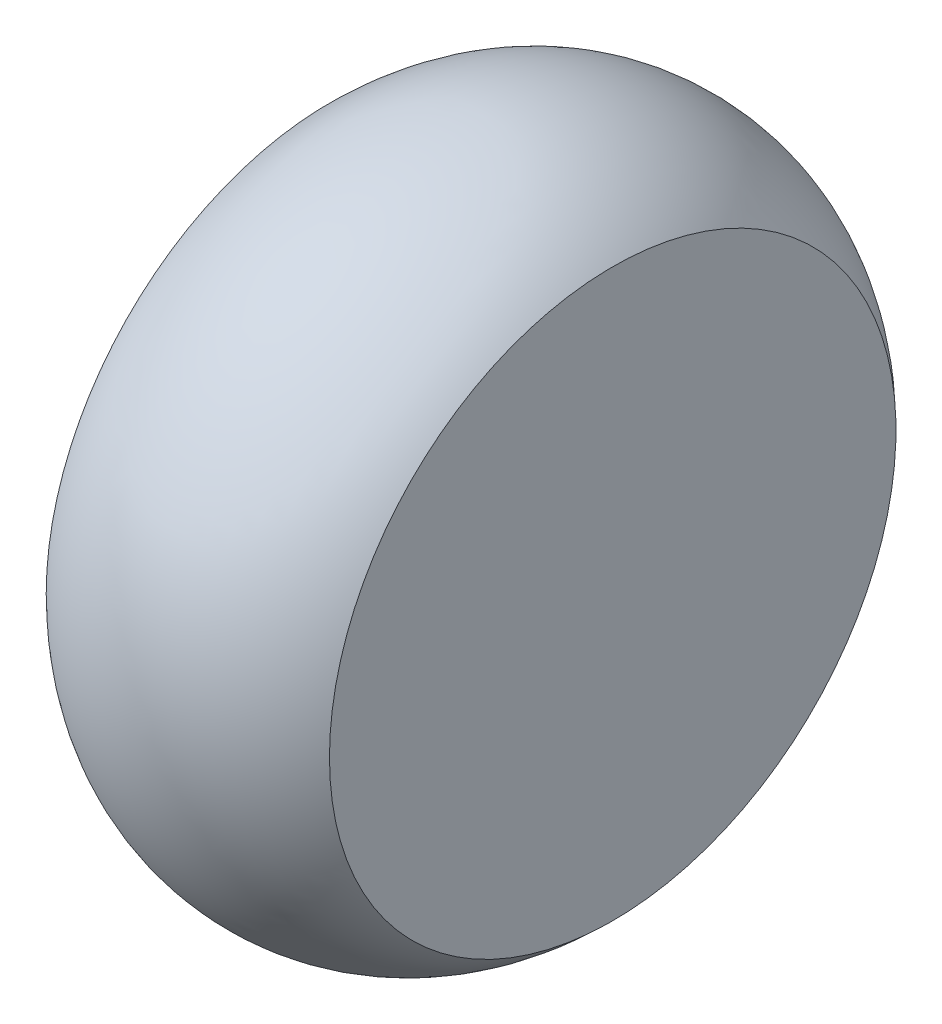
ISO-10303-21;
HEADER;
FILE_DESCRIPTION(('STEP AP214'),'2;1');
FILE_NAME('part.step','',(''),(''),'','','');
FILE_SCHEMA(('AUTOMOTIVE_DESIGN { 1 0 10303 214 1 1 1 1 }'));
ENDSEC;
DATA;
#1=APPLICATION_CONTEXT('core data for automotive mechanical design processes');
#2=APPLICATION_PROTOCOL_DEFINITION('international standard','automotive_design',2000,#1);
#3=PRODUCT_CONTEXT('',#1,'mechanical');
#4=PRODUCT('Part','Part','',(#3));
#5=PRODUCT_RELATED_PRODUCT_CATEGORY('part','',(#4));
#6=PRODUCT_DEFINITION_FORMATION('','',#4);
#7=PRODUCT_DEFINITION_CONTEXT('part definition',#1,'design');
#8=PRODUCT_DEFINITION('design','',#6,#7);
#9=PRODUCT_DEFINITION_SHAPE('','',#8);
#10=(LENGTH_UNIT() NAMED_UNIT(*) SI_UNIT(.MILLI.,.METRE.));
#11=(NAMED_UNIT(*) PLANE_ANGLE_UNIT() SI_UNIT($,.RADIAN.));
#12=(NAMED_UNIT(*) SI_UNIT($,.STERADIAN.) SOLID_ANGLE_UNIT());
#13=UNCERTAINTY_MEASURE_WITH_UNIT(LENGTH_MEASURE(1.E-05),#10,'distance_accuracy_value','');
#14=(GEOMETRIC_REPRESENTATION_CONTEXT(3) GLOBAL_UNCERTAINTY_ASSIGNED_CONTEXT((#13)) GLOBAL_UNIT_ASSIGNED_CONTEXT((#10,
#11,#12)) REPRESENTATION_CONTEXT('',''));
#15=CARTESIAN_POINT('',(0.,0.,0.));
#16=DIRECTION('',(0.,0.,1.));
#17=DIRECTION('',(1.,0.,0.));
#18=AXIS2_PLACEMENT_3D('',#15,#16,#17);
#19=CARTESIAN_POINT('',(20.,0.,0.));
#20=DIRECTION('',(1.,0.,0.));
#21=DIRECTION('',(0.,0.,-1.));
#22=AXIS2_PLACEMENT_3D('',#19,#20,#21);
#23=PLANE('',#22);
#24=CARTESIAN_POINT('',(20.,0.,0.));
#25=DIRECTION('',(-1.,0.,0.));
#26=DIRECTION('',(0.,0.,1.));
#27=AXIS2_PLACEMENT_3D('',#24,#25,#26);
#28=CIRCLE('',#27,40.);
#29=CARTESIAN_POINT('',(20.,0.,40.));
#30=VERTEX_POINT('',#29);
#31=EDGE_CURVE('E46',#30,#30,#28,.T.);
#32=ORIENTED_EDGE('',*,*,#31,.F.);
#33=EDGE_LOOP('',(#32));
#34=FACE_BOUND('',#33,.T.);
#35=ADVANCED_FACE('F39',(#34),#23,.T.);
#36=CARTESIAN_POINT('',(0.,0.,0.));
#37=DIRECTION('',(-1.,0.,0.));
#38=DIRECTION('',(0.,0.,1.));
#39=AXIS2_PLACEMENT_3D('',#36,#37,#38);
#40=DEGENERATE_TOROIDAL_SURFACE('',#39,19.9999999999999,28.284271247462,.T.);
#41=ORIENTED_EDGE('',*,*,#31,.T.);
#42=EDGE_LOOP('',(#41));
#43=FACE_BOUND('',#42,.T.);
#44=CARTESIAN_POINT('',(-20.,0.,0.));
#45=DIRECTION('',(1.,0.,0.));
#46=DIRECTION('',(0.,0.,-1.));
#47=AXIS2_PLACEMENT_3D('',#44,#45,#46);
#48=CIRCLE('',#47,40.);
#49=CARTESIAN_POINT('',(-20.,0.,-40.));
#50=VERTEX_POINT('',#49);
#51=EDGE_CURVE('E10',#50,#50,#48,.T.);
#52=ORIENTED_EDGE('',*,*,#51,.T.);
#53=EDGE_LOOP('',(#52));
#54=FACE_BOUND('',#53,.T.);
#55=ADVANCED_FACE('F52',(#43,#54),#40,.T.);
#56=CARTESIAN_POINT('',(-20.,0.,0.));
#57=DIRECTION('',(1.,0.,0.));
#58=DIRECTION('',(0.,0.,-1.));
#59=AXIS2_PLACEMENT_3D('',#56,#57,#58);
#60=PLANE('',#59);
#61=ORIENTED_EDGE('',*,*,#51,.F.);
#62=EDGE_LOOP('',(#61));
#63=FACE_BOUND('',#62,.T.);
#64=ADVANCED_FACE('F41',(#63),#60,.F.);
#65=CLOSED_SHELL('',(#35,#55,#64));
#66=MANIFOLD_SOLID_BREP('B2',#65);
#67=ADVANCED_BREP_SHAPE_REPRESENTATION('',(#18,#66),#14);
#68=SHAPE_DEFINITION_REPRESENTATION(#9,#67);
ENDSEC;
END-ISO-10303-21;
